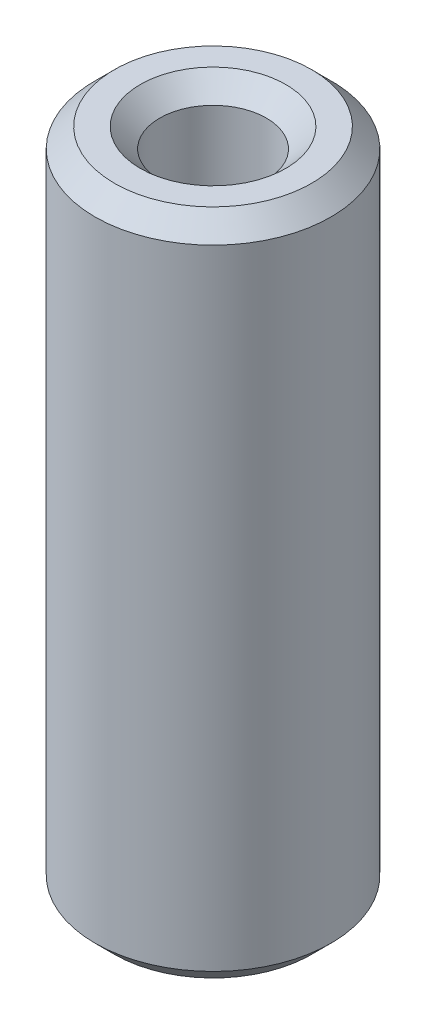
ISO-10303-21;
HEADER;
FILE_DESCRIPTION(('STEP AP214'),'2;1');
FILE_NAME('part.step','',(''),(''),'','','');
FILE_SCHEMA(('AUTOMOTIVE_DESIGN { 1 0 10303 214 1 1 1 1 }'));
ENDSEC;
DATA;
#1=APPLICATION_CONTEXT('core data for automotive mechanical design processes');
#2=APPLICATION_PROTOCOL_DEFINITION('international standard','automotive_design',2000,#1);
#3=PRODUCT_CONTEXT('',#1,'mechanical');
#4=PRODUCT('Part','Part','',(#3));
#5=PRODUCT_RELATED_PRODUCT_CATEGORY('part','',(#4));
#6=PRODUCT_DEFINITION_FORMATION('','',#4);
#7=PRODUCT_DEFINITION_CONTEXT('part definition',#1,'design');
#8=PRODUCT_DEFINITION('design','',#6,#7);
#9=PRODUCT_DEFINITION_SHAPE('','',#8);
#10=(LENGTH_UNIT() NAMED_UNIT(*) SI_UNIT(.MILLI.,.METRE.));
#11=(NAMED_UNIT(*) PLANE_ANGLE_UNIT() SI_UNIT($,.RADIAN.));
#12=(NAMED_UNIT(*) SI_UNIT($,.STERADIAN.) SOLID_ANGLE_UNIT());
#13=UNCERTAINTY_MEASURE_WITH_UNIT(LENGTH_MEASURE(1.E-05),#10,'distance_accuracy_value','');
#14=(GEOMETRIC_REPRESENTATION_CONTEXT(3) GLOBAL_UNCERTAINTY_ASSIGNED_CONTEXT((#13)) GLOBAL_UNIT_ASSIGNED_CONTEXT((#10,
#11,#12)) REPRESENTATION_CONTEXT('',''));
#15=CARTESIAN_POINT('',(0.,0.,0.));
#16=DIRECTION('',(0.,0.,1.));
#17=DIRECTION('',(1.,0.,0.));
#18=AXIS2_PLACEMENT_3D('',#15,#16,#17);
#19=CARTESIAN_POINT('',(0.,127.362617810102,0.));
#20=DIRECTION('',(0.,-1.,0.));
#21=DIRECTION('',(0.,0.,-1.));
#22=AXIS2_PLACEMENT_3D('',#19,#20,#21);
#23=CYLINDRICAL_SURFACE('',#22,22.5);
#24=CARTESIAN_POINT('',(0.,3.70126560150971,0.));
#25=DIRECTION('',(0.,1.,0.));
#26=DIRECTION('',(0.,0.,1.));
#27=AXIS2_PLACEMENT_3D('',#24,#25,#26);
#28=CIRCLE('',#27,22.5);
#29=CARTESIAN_POINT('',(0.,3.70126560150971,22.5));
#30=VERTEX_POINT('',#29);
#31=EDGE_CURVE('E10',#30,#30,#28,.T.);
#32=ORIENTED_EDGE('',*,*,#31,.T.);
#33=EDGE_LOOP('',(#32));
#34=FACE_BOUND('',#33,.T.);
#35=CARTESIAN_POINT('',(0.,123.661352208593,0.));
#36=DIRECTION('',(0.,1.,0.));
#37=DIRECTION('',(0.,0.,1.));
#38=AXIS2_PLACEMENT_3D('',#35,#36,#37);
#39=CIRCLE('',#38,22.5);
#40=CARTESIAN_POINT('',(0.,123.661352208593,22.5));
#41=VERTEX_POINT('',#40);
#42=EDGE_CURVE('E50',#41,#41,#39,.F.);
#43=ORIENTED_EDGE('',*,*,#42,.T.);
#44=EDGE_LOOP('',(#43));
#45=FACE_BOUND('',#44,.T.);
#46=ADVANCED_FACE('F39',(#34,#45),#23,.T.);
#47=CARTESIAN_POINT('',(0.,127.362617810102,0.));
#48=DIRECTION('',(0.,1.,0.));
#49=DIRECTION('',(0.,0.,1.));
#50=AXIS2_PLACEMENT_3D('',#47,#48,#49);
#51=PLANE('',#50);
#52=CARTESIAN_POINT('',(0.,127.362617810102,0.));
#53=DIRECTION('',(0.,1.,0.));
#54=DIRECTION('',(0.,0.,1.));
#55=AXIS2_PLACEMENT_3D('',#52,#53,#54);
#56=CIRCLE('',#55,13.8767695535562);
#57=CARTESIAN_POINT('',(0.,127.362617810102,13.8767695535562));
#58=VERTEX_POINT('',#57);
#59=EDGE_CURVE('E58',#58,#58,#56,.F.);
#60=ORIENTED_EDGE('',*,*,#59,.T.);
#61=EDGE_LOOP('',(#60));
#62=FACE_BOUND('',#61,.T.);
#63=CARTESIAN_POINT('',(0.,127.362617810102,0.));
#64=DIRECTION('',(0.,1.,0.));
#65=DIRECTION('',(0.,0.,1.));
#66=AXIS2_PLACEMENT_3D('',#63,#64,#65);
#67=CIRCLE('',#66,18.7987343984904);
#68=CARTESIAN_POINT('',(0.,127.362617810102,18.7987343984904));
#69=VERTEX_POINT('',#68);
#70=EDGE_CURVE('E61',#69,#69,#67,.T.);
#71=ORIENTED_EDGE('',*,*,#70,.T.);
#72=EDGE_LOOP('',(#71));
#73=FACE_BOUND('',#72,.T.);
#74=ADVANCED_FACE('F88',(#62,#73),#51,.T.);
#75=CARTESIAN_POINT('',(0.,0.,0.));
#76=DIRECTION('',(0.,1.,0.));
#77=DIRECTION('',(0.,0.,1.));
#78=AXIS2_PLACEMENT_3D('',#75,#76,#77);
#79=PLANE('',#78);
#80=CARTESIAN_POINT('',(0.,0.,0.));
#81=DIRECTION('',(0.,1.,0.));
#82=DIRECTION('',(0.,0.,1.));
#83=AXIS2_PLACEMENT_3D('',#80,#81,#82);
#84=CIRCLE('',#83,13.8767695535562);
#85=CARTESIAN_POINT('',(0.,0.,-13.8767695535562));
#86=VERTEX_POINT('',#85);
#87=EDGE_CURVE('E51',#86,#86,#84,.T.);
#88=ORIENTED_EDGE('',*,*,#87,.T.);
#89=EDGE_LOOP('',(#88));
#90=FACE_BOUND('',#89,.T.);
#91=CARTESIAN_POINT('',(0.,0.,0.));
#92=DIRECTION('',(0.,1.,0.));
#93=DIRECTION('',(0.,0.,1.));
#94=AXIS2_PLACEMENT_3D('',#91,#92,#93);
#95=CIRCLE('',#94,18.7987343984903);
#96=CARTESIAN_POINT('',(0.,0.,18.7987343984903));
#97=VERTEX_POINT('',#96);
#98=EDGE_CURVE('E54',#97,#97,#95,.F.);
#99=ORIENTED_EDGE('',*,*,#98,.T.);
#100=EDGE_LOOP('',(#99));
#101=FACE_BOUND('',#100,.T.);
#102=ADVANCED_FACE('F83',(#90,#101),#79,.F.);
#103=CARTESIAN_POINT('',(0.,127.362617810102,0.));
#104=DIRECTION('',(0.,-1.,0.));
#105=DIRECTION('',(0.,0.,-1.));
#106=AXIS2_PLACEMENT_3D('',#103,#104,#105);
#107=CYLINDRICAL_SURFACE('',#106,10.1755039520465);
#108=CARTESIAN_POINT('',(0.,123.661352208593,0.));
#109=DIRECTION('',(0.,1.,0.));
#110=DIRECTION('',(0.,0.,1.));
#111=AXIS2_PLACEMENT_3D('',#108,#109,#110);
#112=CIRCLE('',#111,10.1755039520465);
#113=CARTESIAN_POINT('',(0.,123.661352208593,10.1755039520465));
#114=VERTEX_POINT('',#113);
#115=EDGE_CURVE('E67',#114,#114,#112,.T.);
#116=ORIENTED_EDGE('',*,*,#115,.T.);
#117=EDGE_LOOP('',(#116));
#118=FACE_BOUND('',#117,.T.);
#119=CARTESIAN_POINT('',(0.,3.7012656015097,0.));
#120=DIRECTION('',(0.,1.,0.));
#121=DIRECTION('',(0.,0.,1.));
#122=AXIS2_PLACEMENT_3D('',#119,#120,#121);
#123=CIRCLE('',#122,10.1755039520465);
#124=CARTESIAN_POINT('',(0.,3.7012656015097,-10.1755039520465));
#125=VERTEX_POINT('',#124);
#126=EDGE_CURVE('E69',#125,#125,#123,.F.);
#127=ORIENTED_EDGE('',*,*,#126,.T.);
#128=EDGE_LOOP('',(#127));
#129=FACE_BOUND('',#128,.T.);
#130=ADVANCED_FACE('F71',(#118,#129),#107,.F.);
#131=CARTESIAN_POINT('',(0.,123.661352208593,0.));
#132=DIRECTION('',(0.,1.,0.));
#133=DIRECTION('',(0.,0.,1.));
#134=AXIS2_PLACEMENT_3D('',#131,#132,#133);
#135=CONICAL_SURFACE('',#134,10.1755039520465,0.78539816339745);
#136=ORIENTED_EDGE('',*,*,#59,.F.);
#137=EDGE_LOOP('',(#136));
#138=FACE_BOUND('',#137,.T.);
#139=ORIENTED_EDGE('',*,*,#115,.F.);
#140=EDGE_LOOP('',(#139));
#141=FACE_BOUND('',#140,.T.);
#142=ADVANCED_FACE('F77',(#138,#141),#135,.F.);
#143=CARTESIAN_POINT('',(0.,0.,0.));
#144=DIRECTION('',(0.,-1.,0.));
#145=DIRECTION('',(0.,0.,-1.));
#146=AXIS2_PLACEMENT_3D('',#143,#144,#145);
#147=CONICAL_SURFACE('',#146,13.8767695535562,0.785398163397444);
#148=CARTESIAN_POINT('',(0.,3.7012656015097,-10.1755039520465));
#149=CARTESIAN_POINT('',(0.,3.66271075149397,-10.2140588020622));
#150=CARTESIAN_POINT('',(0.,3.62415590147825,-10.252613652078));
#151=CARTESIAN_POINT('',(0.,3.54704620144679,-10.3297233521094));
#152=CARTESIAN_POINT('',(0.,3.50849135143107,-10.3682782021251));
#153=CARTESIAN_POINT('',(0.,3.43138165139962,-10.4453879021566));
#154=CARTESIAN_POINT('',(0.,3.39282680138389,-10.4839427521723));
#155=CARTESIAN_POINT('',(0.,3.31571710135244,-10.5610524522038));
#156=CARTESIAN_POINT('',(0.,3.27716225133671,-10.5996073022195));
#157=CARTESIAN_POINT('',(0.,3.20005255130526,-10.6767170022509));
#158=CARTESIAN_POINT('',(0.,3.16149770128953,-10.7152718522667));
#159=CARTESIAN_POINT('',(0.,3.08438800125808,-10.7923815522981));
#160=CARTESIAN_POINT('',(0.,3.04583315124236,-10.8309364023139));
#161=CARTESIAN_POINT('',(0.,2.9687234512109,-10.9080461023453));
#162=CARTESIAN_POINT('',(0.,2.93016860119518,-10.946600952361));
#163=CARTESIAN_POINT('',(0.,2.85305890116373,-11.0237106523925));
#164=CARTESIAN_POINT('',(0.,2.814504051148,-11.0622655024082));
#165=CARTESIAN_POINT('',(0.,2.73739435111655,-11.1393752024397));
#166=CARTESIAN_POINT('',(0.,2.69883950110082,-11.1779300524554));
#167=CARTESIAN_POINT('',(0.,2.62172980106937,-11.2550397524868));
#168=CARTESIAN_POINT('',(0.,2.58317495105364,-11.2935946025026));
#169=CARTESIAN_POINT('',(0.,2.50606525102219,-11.370704302534));
#170=CARTESIAN_POINT('',(0.,2.46751040100647,-11.4092591525497));
#171=CARTESIAN_POINT('',(0.,2.39040070097501,-11.4863688525812));
#172=CARTESIAN_POINT('',(0.,2.35184585095929,-11.5249237025969));
#173=CARTESIAN_POINT('',(0.,2.27473615092783,-11.6020334026284));
#174=CARTESIAN_POINT('',(0.,2.23618130091211,-11.6405882526441));
#175=CARTESIAN_POINT('',(0.,2.15907160088066,-11.7176979526755));
#176=CARTESIAN_POINT('',(0.,2.12051675086493,-11.7562528026913));
#177=CARTESIAN_POINT('',(0.,2.04340705083348,-11.8333625027227));
#178=CARTESIAN_POINT('',(0.,2.00485220081775,-11.8719173527384));
#179=CARTESIAN_POINT('',(0.,1.9277425007863,-11.9490270527699));
#180=CARTESIAN_POINT('',(0.,1.88918765077057,-11.9875819027856));
#181=CARTESIAN_POINT('',(0.,1.81207795073912,-12.0646916028171));
#182=CARTESIAN_POINT('',(0.,1.7735231007234,-12.1032464528328));
#183=CARTESIAN_POINT('',(0.,1.69641340069194,-12.1803561528643));
#184=CARTESIAN_POINT('',(0.,1.65785855067622,-12.21891100288));
#185=CARTESIAN_POINT('',(0.,1.58074885064477,-12.2960207029114));
#186=CARTESIAN_POINT('',(0.,1.54219400062904,-12.3345755529272));
#187=CARTESIAN_POINT('',(0.,1.46508430059759,-12.4116852529586));
#188=CARTESIAN_POINT('',(0.,1.42652945058186,-12.4502401029743));
#189=CARTESIAN_POINT('',(0.,1.34941975055041,-12.5273498030058));
#190=CARTESIAN_POINT('',(0.,1.31086490053468,-12.5659046530215));
#191=CARTESIAN_POINT('',(0.,1.23375520050323,-12.643014353053));
#192=CARTESIAN_POINT('',(0.,1.19520035048751,-12.6815692030687));
#193=CARTESIAN_POINT('',(0.,1.11809065045605,-12.7586789031001));
#194=CARTESIAN_POINT('',(0.,1.07953580044033,-12.7972337531159));
#195=CARTESIAN_POINT('',(0.,1.00242610040888,-12.8743434531473));
#196=CARTESIAN_POINT('',(0.,0.96387125039315,-12.912898303163));
#197=CARTESIAN_POINT('',(0.,0.886761550361698,-12.9900080031945));
#198=CARTESIAN_POINT('',(0.,0.848206700345972,-13.0285628532102));
#199=CARTESIAN_POINT('',(0.,0.77109700031452,-13.1056725532417));
#200=CARTESIAN_POINT('',(0.,0.732542150298795,-13.1442274032574));
#201=CARTESIAN_POINT('',(0.,0.655432450267342,-13.2213371032888));
#202=CARTESIAN_POINT('',(0.,0.616877600251616,-13.2598919533046));
#203=CARTESIAN_POINT('',(0.,0.539767900220164,-13.337001653336));
#204=CARTESIAN_POINT('',(0.,0.501213050204438,-13.3755565033517));
#205=CARTESIAN_POINT('',(0.,0.424103350172986,-13.4526662033832));
#206=CARTESIAN_POINT('',(0.,0.38554850015726,-13.4912210533989));
#207=CARTESIAN_POINT('',(0.,0.308438800125808,-13.5683307534304));
#208=CARTESIAN_POINT('',(0.,0.269883950110082,-13.6068856034461));
#209=CARTESIAN_POINT('',(0.,0.19277425007863,-13.6839953034776));
#210=CARTESIAN_POINT('',(0.,0.154219400062904,-13.7225501534933));
#211=CARTESIAN_POINT('',(0.,0.0771097000314517,-13.7996598535247));
#212=CARTESIAN_POINT('',(0.,0.0385548500157256,-13.8382147035405));
#213=CARTESIAN_POINT('',(0.,0.,-13.8767695535562));
#214=B_SPLINE_CURVE_WITH_KNOTS('',3,(#148,#149,#150,#151,#152,#153,#154,#155,#156,#157,#158,
#159,#160,#161,#162,#163,#164,#165,#166,#167,#168,#169,#170,#171,#172,#173,#174,#175,#176,#177,
#178,#179,#180,#181,#182,#183,#184,#185,#186,#187,#188,#189,#190,#191,#192,#193,#194,#195,#196,
#197,#198,#199,#200,#201,#202,#203,#204,#205,#206,#207,#208,#209,#210,#211,#212,#213),
.UNSPECIFIED.,.F.,.F.,(4,2,2,2,2,2,2,2,2,2,2,2,2,2,2,2,2,2,2,2,2,2,2,2,2,2,2,2,2,2,2,2,4),(0.,
0.163574375362501,0.327148750725,0.4907231260875,0.654297501450001,0.817871876812501,
0.981446252175001,1.1450206275375,1.3085950029,1.4721693782625,1.635743753625,1.7993181289875,
1.96289250435,2.1264668797125,2.290041255075,2.4536156304375,2.6171900058,2.7807643811625,
2.944338756525,3.1079131318875,3.27148750725,3.43506188261251,3.59863625797501,3.76221063333751,
3.92578500870001,4.08935938406251,4.25293375942501,4.41650813478751,4.58008251015001,
4.74365688551251,4.90723126087501,5.07080563623751,5.23438001160001),.UNSPECIFIED.);
#215=EDGE_CURVE('BSEAM73',#125,#86,#214,.T.);
#216=ORIENTED_EDGE('',*,*,#126,.F.);
#217=ORIENTED_EDGE('',*,*,#87,.F.);
#218=ORIENTED_EDGE('',*,*,#215,.T.);
#219=ORIENTED_EDGE('',*,*,#215,.F.);
#220=EDGE_LOOP('',(#216,#218,#217,#219));
#221=FACE_BOUND('',#220,.T.);
#222=ADVANCED_FACE('F73',(#221),#147,.F.);
#223=CARTESIAN_POINT('',(0.,3.70126560150971,0.));
#224=DIRECTION('',(0.,1.,0.));
#225=DIRECTION('',(0.,0.,1.));
#226=AXIS2_PLACEMENT_3D('',#223,#224,#225);
#227=CONICAL_SURFACE('',#226,22.5,0.785398163397452);
#228=ORIENTED_EDGE('',*,*,#98,.F.);
#229=EDGE_LOOP('',(#228));
#230=FACE_BOUND('',#229,.T.);
#231=ORIENTED_EDGE('',*,*,#31,.F.);
#232=EDGE_LOOP('',(#231));
#233=FACE_BOUND('',#232,.T.);
#234=ADVANCED_FACE('F76',(#230,#233),#227,.T.);
#235=CARTESIAN_POINT('',(0.,127.362617810102,0.));
#236=DIRECTION('',(0.,-1.,0.));
#237=DIRECTION('',(0.,0.,-1.));
#238=AXIS2_PLACEMENT_3D('',#235,#236,#237);
#239=CONICAL_SURFACE('',#238,18.7987343984904,0.785398163397446);
#240=ORIENTED_EDGE('',*,*,#42,.F.);
#241=EDGE_LOOP('',(#240));
#242=FACE_BOUND('',#241,.T.);
#243=ORIENTED_EDGE('',*,*,#70,.F.);
#244=EDGE_LOOP('',(#243));
#245=FACE_BOUND('',#244,.T.);
#246=ADVANCED_FACE('F45',(#242,#245),#239,.T.);
#247=CLOSED_SHELL('',(#46,#74,#102,#130,#142,#222,#234,#246));
#248=MANIFOLD_SOLID_BREP('B2',#247);
#249=ADVANCED_BREP_SHAPE_REPRESENTATION('',(#18,#248),#14);
#250=SHAPE_DEFINITION_REPRESENTATION(#9,#249);
ENDSEC;
END-ISO-10303-21;
